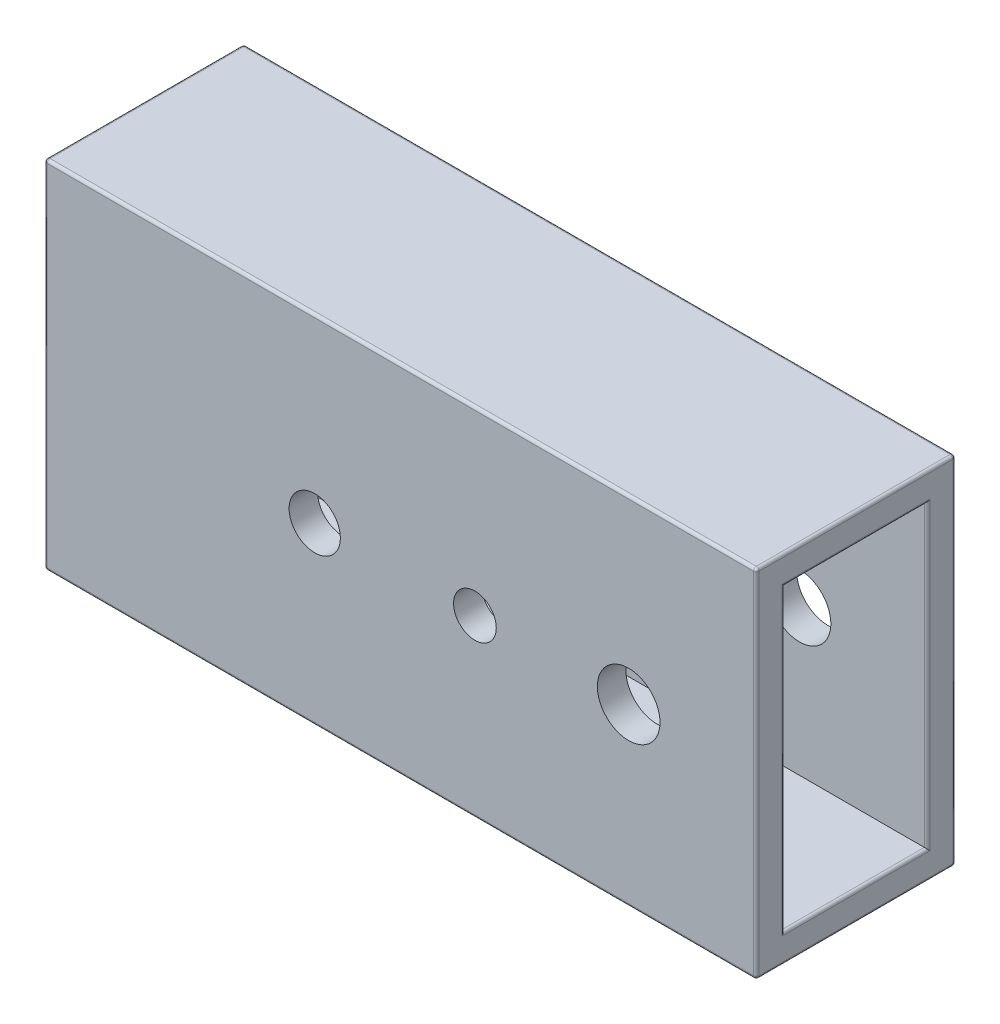
ISO-10303-21;
HEADER;
FILE_DESCRIPTION(('STEP AP214'),'2;1');
FILE_NAME('part.step','',(''),(''),'','','');
FILE_SCHEMA(('AUTOMOTIVE_DESIGN { 1 0 10303 214 1 1 1 1 }'));
ENDSEC;
DATA;
#1=APPLICATION_CONTEXT('core data for automotive mechanical design processes');
#2=APPLICATION_PROTOCOL_DEFINITION('international standard','automotive_design',2000,#1);
#3=PRODUCT_CONTEXT('',#1,'mechanical');
#4=PRODUCT('Part','Part','',(#3));
#5=PRODUCT_RELATED_PRODUCT_CATEGORY('part','',(#4));
#6=PRODUCT_DEFINITION_FORMATION('','',#4);
#7=PRODUCT_DEFINITION_CONTEXT('part definition',#1,'design');
#8=PRODUCT_DEFINITION('design','',#6,#7);
#9=PRODUCT_DEFINITION_SHAPE('','',#8);
#10=(LENGTH_UNIT() NAMED_UNIT(*) SI_UNIT(.MILLI.,.METRE.));
#11=(NAMED_UNIT(*) PLANE_ANGLE_UNIT() SI_UNIT($,.RADIAN.));
#12=(NAMED_UNIT(*) SI_UNIT($,.STERADIAN.) SOLID_ANGLE_UNIT());
#13=UNCERTAINTY_MEASURE_WITH_UNIT(LENGTH_MEASURE(1.E-05),#10,'distance_accuracy_value','');
#14=(GEOMETRIC_REPRESENTATION_CONTEXT(3) GLOBAL_UNCERTAINTY_ASSIGNED_CONTEXT((#13)) GLOBAL_UNIT_ASSIGNED_CONTEXT((#10,
#11,#12)) REPRESENTATION_CONTEXT('',''));
#15=CARTESIAN_POINT('',(0.,0.,0.));
#16=DIRECTION('',(0.,0.,1.));
#17=DIRECTION('',(1.,0.,0.));
#18=AXIS2_PLACEMENT_3D('',#15,#16,#17);
#19=CARTESIAN_POINT('',(-5.18828451882847,93.4309623430963,35.0000000000001));
#20=DIRECTION('',(-1.,0.,0.));
#21=DIRECTION('',(0.,-1.,0.));
#22=AXIS2_PLACEMENT_3D('',#19,#20,#21);
#23=PLANE('',#22);
#24=DIRECTION('',(0.,1.,0.));
#25=VECTOR('',#24,1.);
#26=CARTESIAN_POINT('',(-5.18828451882847,93.4309623430963,26.));
#27=LINE('',#26,#25);
#28=CARTESIAN_POINT('',(-5.18828451882846,-22.5690376569038,26.));
#29=VERTEX_POINT('',#28);
#30=CARTESIAN_POINT('',(-5.18828451882847,84.4309623430962,26.));
#31=VERTEX_POINT('',#30);
#32=EDGE_CURVE('E271',#29,#31,#27,.T.);
#33=ORIENTED_EDGE('',*,*,#32,.T.);
#34=DIRECTION('',(0.,0.,-1.));
#35=VECTOR('',#34,1.);
#36=CARTESIAN_POINT('',(-5.18828451882847,84.4309623430962,-25.));
#37=LINE('',#36,#35);
#38=CARTESIAN_POINT('',(-5.18828451882847,84.4309623430962,-26.));
#39=VERTEX_POINT('',#38);
#40=EDGE_CURVE('E273',#31,#39,#37,.T.);
#41=ORIENTED_EDGE('',*,*,#40,.T.);
#42=DIRECTION('',(0.,1.,0.));
#43=VECTOR('',#42,1.);
#44=CARTESIAN_POINT('',(-5.18828451882846,-21.5690376569038,-26.));
#45=LINE('',#44,#43);
#46=CARTESIAN_POINT('',(-5.18828451882846,-22.5690376569038,-26.));
#47=VERTEX_POINT('',#46);
#48=EDGE_CURVE('E267',#39,#47,#45,.F.);
#49=ORIENTED_EDGE('',*,*,#48,.T.);
#50=DIRECTION('',(0.,0.,-1.));
#51=VECTOR('',#50,1.);
#52=CARTESIAN_POINT('',(-5.18828451882846,-22.5690376569038,25.));
#53=LINE('',#52,#51);
#54=EDGE_CURVE('E269',#47,#29,#53,.F.);
#55=ORIENTED_EDGE('',*,*,#54,.T.);
#56=EDGE_LOOP('',(#33,#41,#49,#55));
#57=FACE_BOUND('',#56,.T.);
#58=DIRECTION('',(0.,1.,0.));
#59=VECTOR('',#58,1.);
#60=CARTESIAN_POINT('',(-5.18828451882846,-31.5690376569038,34.));
#61=LINE('',#60,#59);
#62=CARTESIAN_POINT('',(-5.18828451882847,92.4309623430963,34.));
#63=VERTEX_POINT('',#62);
#64=CARTESIAN_POINT('',(-5.18828451882846,-30.5690376569038,34.));
#65=VERTEX_POINT('',#64);
#66=EDGE_CURVE('E262',#63,#65,#61,.F.);
#67=ORIENTED_EDGE('',*,*,#66,.T.);
#68=DIRECTION('',(0.,0.,-1.));
#69=VECTOR('',#68,1.);
#70=CARTESIAN_POINT('',(-5.18828451882846,-30.5690376569038,35.0000000000001));
#71=LINE('',#70,#69);
#72=CARTESIAN_POINT('',(-5.18828451882846,-30.5690376569038,-34.));
#73=VERTEX_POINT('',#72);
#74=EDGE_CURVE('E264',#65,#73,#71,.T.);
#75=ORIENTED_EDGE('',*,*,#74,.T.);
#76=DIRECTION('',(0.,1.,0.));
#77=VECTOR('',#76,1.);
#78=CARTESIAN_POINT('',(-5.18828451882847,93.4309623430963,-34.));
#79=LINE('',#78,#77);
#80=CARTESIAN_POINT('',(-5.18828451882847,92.4309623430963,-34.));
#81=VERTEX_POINT('',#80);
#82=EDGE_CURVE('E260',#73,#81,#79,.T.);
#83=ORIENTED_EDGE('',*,*,#82,.T.);
#84=DIRECTION('',(0.,0.,-1.));
#85=VECTOR('',#84,1.);
#86=CARTESIAN_POINT('',(-5.18828451882847,92.4309623430963,35.0000000000001));
#87=LINE('',#86,#85);
#88=EDGE_CURVE('E258',#81,#63,#87,.F.);
#89=ORIENTED_EDGE('',*,*,#88,.T.);
#90=EDGE_LOOP('',(#67,#75,#83,#89));
#91=FACE_BOUND('',#90,.T.);
#92=ADVANCED_FACE('F47',(#57,#91),#23,.F.);
#93=CARTESIAN_POINT('',(-255.188284518828,93.4309623430963,35.));
#94=DIRECTION('',(0.,-1.,0.));
#95=DIRECTION('',(0.,0.,-1.));
#96=AXIS2_PLACEMENT_3D('',#93,#94,#95);
#97=PLANE('',#96);
#98=DIRECTION('',(-1.,0.,0.));
#99=VECTOR('',#98,1.);
#100=CARTESIAN_POINT('',(-5.18828451882847,93.4309623430963,34.));
#101=LINE('',#100,#99);
#102=CARTESIAN_POINT('',(-254.188284518828,93.4309623430963,34.));
#103=VERTEX_POINT('',#102);
#104=CARTESIAN_POINT('',(-6.18828451882847,93.4309623430963,34.));
#105=VERTEX_POINT('',#104);
#106=EDGE_CURVE('E56',#103,#105,#101,.F.);
#107=ORIENTED_EDGE('',*,*,#106,.T.);
#108=DIRECTION('',(0.,0.,-1.));
#109=VECTOR('',#108,1.);
#110=CARTESIAN_POINT('',(-6.18828451882847,93.4309623430963,35.));
#111=LINE('',#110,#109);
#112=CARTESIAN_POINT('',(-6.18828451882847,93.4309623430963,-34.));
#113=VERTEX_POINT('',#112);
#114=EDGE_CURVE('E11',#105,#113,#111,.T.);
#115=ORIENTED_EDGE('',*,*,#114,.T.);
#116=DIRECTION('',(-1.,0.,0.));
#117=VECTOR('',#116,1.);
#118=CARTESIAN_POINT('',(-255.188284518828,93.4309623430963,-34.));
#119=LINE('',#118,#117);
#120=CARTESIAN_POINT('',(-254.188284518828,93.4309623430963,-34.));
#121=VERTEX_POINT('',#120);
#122=EDGE_CURVE('E292',#113,#121,#119,.T.);
#123=ORIENTED_EDGE('',*,*,#122,.T.);
#124=DIRECTION('',(0.,0.,-1.));
#125=VECTOR('',#124,1.);
#126=CARTESIAN_POINT('',(-254.188284518828,93.4309623430963,35.));
#127=LINE('',#126,#125);
#128=EDGE_CURVE('E67',#121,#103,#127,.F.);
#129=ORIENTED_EDGE('',*,*,#128,.T.);
#130=EDGE_LOOP('',(#107,#115,#123,#129));
#131=FACE_BOUND('',#130,.T.);
#132=ADVANCED_FACE('F456',(#131),#97,.F.);
#133=CARTESIAN_POINT('',(-255.188284518828,93.4309623430963,35.));
#134=DIRECTION('',(1.,0.,0.));
#135=DIRECTION('',(0.,0.,-1.));
#136=AXIS2_PLACEMENT_3D('',#133,#134,#135);
#137=PLANE('',#136);
#138=DIRECTION('',(0.,0.,-1.));
#139=VECTOR('',#138,1.);
#140=CARTESIAN_POINT('',(-255.188284518828,-30.5690376569038,35.));
#141=LINE('',#140,#139);
#142=CARTESIAN_POINT('',(-255.188284518828,-30.5690376569038,-34.));
#143=VERTEX_POINT('',#142);
#144=CARTESIAN_POINT('',(-255.188284518828,-30.5690376569038,34.));
#145=VERTEX_POINT('',#144);
#146=EDGE_CURVE('E287',#143,#145,#141,.F.);
#147=ORIENTED_EDGE('',*,*,#146,.T.);
#148=DIRECTION('',(0.,-1.,0.));
#149=VECTOR('',#148,1.);
#150=CARTESIAN_POINT('',(-255.188284518828,93.4309623430963,34.));
#151=LINE('',#150,#149);
#152=CARTESIAN_POINT('',(-255.188284518828,92.4309623430963,34.));
#153=VERTEX_POINT('',#152);
#154=EDGE_CURVE('E289',#145,#153,#151,.F.);
#155=ORIENTED_EDGE('',*,*,#154,.T.);
#156=DIRECTION('',(0.,0.,-1.));
#157=VECTOR('',#156,1.);
#158=CARTESIAN_POINT('',(-255.188284518828,92.4309623430963,35.));
#159=LINE('',#158,#157);
#160=CARTESIAN_POINT('',(-255.188284518828,92.4309623430963,-34.));
#161=VERTEX_POINT('',#160);
#162=EDGE_CURVE('E283',#153,#161,#159,.T.);
#163=ORIENTED_EDGE('',*,*,#162,.T.);
#164=DIRECTION('',(0.,-1.,0.));
#165=VECTOR('',#164,1.);
#166=CARTESIAN_POINT('',(-255.188284518828,93.4309623430963,-34.));
#167=LINE('',#166,#165);
#168=EDGE_CURVE('E285',#161,#143,#167,.T.);
#169=ORIENTED_EDGE('',*,*,#168,.T.);
#170=EDGE_LOOP('',(#147,#155,#163,#169));
#171=FACE_BOUND('',#170,.T.);
#172=ADVANCED_FACE('F462',(#171),#137,.F.);
#173=CARTESIAN_POINT('',(-255.188284518828,-31.5690376569038,35.));
#174=DIRECTION('',(0.,1.,0.));
#175=DIRECTION('',(0.,0.,1.));
#176=AXIS2_PLACEMENT_3D('',#173,#174,#175);
#177=PLANE('',#176);
#178=DIRECTION('',(1.,0.,0.));
#179=VECTOR('',#178,1.);
#180=CARTESIAN_POINT('',(-255.188284518828,-31.5690376569038,-34.));
#181=LINE('',#180,#179);
#182=CARTESIAN_POINT('',(-254.188284518828,-31.5690376569038,-34.));
#183=VERTEX_POINT('',#182);
#184=CARTESIAN_POINT('',(-6.18828451882846,-31.5690376569038,-34.));
#185=VERTEX_POINT('',#184);
#186=EDGE_CURVE('E242',#183,#185,#181,.T.);
#187=ORIENTED_EDGE('',*,*,#186,.T.);
#188=DIRECTION('',(0.,0.,-1.));
#189=VECTOR('',#188,1.);
#190=CARTESIAN_POINT('',(-6.18828451882847,-31.5690376569038,35.));
#191=LINE('',#190,#189);
#192=CARTESIAN_POINT('',(-6.18828451882846,-31.5690376569038,34.));
#193=VERTEX_POINT('',#192);
#194=EDGE_CURVE('E247',#185,#193,#191,.F.);
#195=ORIENTED_EDGE('',*,*,#194,.T.);
#196=DIRECTION('',(1.,0.,0.));
#197=VECTOR('',#196,1.);
#198=CARTESIAN_POINT('',(-255.188284518828,-31.5690376569038,34.));
#199=LINE('',#198,#197);
#200=CARTESIAN_POINT('',(-254.188284518828,-31.5690376569038,34.));
#201=VERTEX_POINT('',#200);
#202=EDGE_CURVE('E244',#193,#201,#199,.F.);
#203=ORIENTED_EDGE('',*,*,#202,.T.);
#204=DIRECTION('',(0.,0.,-1.));
#205=VECTOR('',#204,1.);
#206=CARTESIAN_POINT('',(-254.188284518828,-31.5690376569038,35.));
#207=LINE('',#206,#205);
#208=EDGE_CURVE('E240',#201,#183,#207,.T.);
#209=ORIENTED_EDGE('',*,*,#208,.T.);
#210=EDGE_LOOP('',(#187,#195,#203,#209));
#211=FACE_BOUND('',#210,.T.);
#212=ADVANCED_FACE('F762',(#211),#177,.F.);
#213=CARTESIAN_POINT('',(0.,0.,35.));
#214=DIRECTION('',(0.,0.,1.));
#215=DIRECTION('',(1.,0.,0.));
#216=AXIS2_PLACEMENT_3D('',#213,#214,#215);
#217=PLANE('',#216);
#218=DIRECTION('',(0.,-1.,0.));
#219=VECTOR('',#218,1.);
#220=CARTESIAN_POINT('',(-254.188284518828,-31.5690376569038,35.));
#221=LINE('',#220,#219);
#222=CARTESIAN_POINT('',(-254.188284518828,92.4309623430963,35.));
#223=VERTEX_POINT('',#222);
#224=CARTESIAN_POINT('',(-254.188284518828,-30.5690376569038,35.));
#225=VERTEX_POINT('',#224);
#226=EDGE_CURVE('E233',#223,#225,#221,.T.);
#227=ORIENTED_EDGE('',*,*,#226,.T.);
#228=DIRECTION('',(1.,0.,0.));
#229=VECTOR('',#228,1.);
#230=CARTESIAN_POINT('',(-5.18828451882846,-30.5690376569038,35.));
#231=LINE('',#230,#229);
#232=CARTESIAN_POINT('',(-6.18828451882846,-30.5690376569038,35.));
#233=VERTEX_POINT('',#232);
#234=EDGE_CURVE('E237',#225,#233,#231,.T.);
#235=ORIENTED_EDGE('',*,*,#234,.T.);
#236=DIRECTION('',(0.,1.,0.));
#237=VECTOR('',#236,1.);
#238=CARTESIAN_POINT('',(-6.18828451882847,93.4309623430963,35.));
#239=LINE('',#238,#237);
#240=CARTESIAN_POINT('',(-6.18828451882847,92.4309623430963,35.));
#241=VERTEX_POINT('',#240);
#242=EDGE_CURVE('E235',#233,#241,#239,.T.);
#243=ORIENTED_EDGE('',*,*,#242,.T.);
#244=DIRECTION('',(-1.,0.,0.));
#245=VECTOR('',#244,1.);
#246=CARTESIAN_POINT('',(-255.188284518828,92.4309623430963,35.));
#247=LINE('',#246,#245);
#248=EDGE_CURVE('E193',#241,#223,#247,.T.);
#249=ORIENTED_EDGE('',*,*,#248,.T.);
#250=EDGE_LOOP('',(#227,#235,#243,#249));
#251=FACE_BOUND('',#250,.T.);
#252=CARTESIAN_POINT('',(-50.,30.,35.));
#253=DIRECTION('',(0.,0.,1.));
#254=DIRECTION('',(1.,0.,0.));
#255=AXIS2_PLACEMENT_3D('',#252,#253,#254);
#256=CIRCLE('',#255,11.);
#257=CARTESIAN_POINT('',(-39.,30.,35.));
#258=VERTEX_POINT('',#257);
#259=EDGE_CURVE('E408',#258,#258,#256,.T.);
#260=ORIENTED_EDGE('',*,*,#259,.F.);
#261=EDGE_LOOP('',(#260));
#262=FACE_BOUND('',#261,.T.);
#263=CARTESIAN_POINT('',(-104.,30.,35.));
#264=DIRECTION('',(0.,0.,1.));
#265=DIRECTION('',(1.,0.,0.));
#266=AXIS2_PLACEMENT_3D('',#263,#264,#265);
#267=CIRCLE('',#266,7.50000000000001);
#268=CARTESIAN_POINT('',(-96.5,30.,35.));
#269=VERTEX_POINT('',#268);
#270=EDGE_CURVE('E403',#269,#269,#267,.T.);
#271=ORIENTED_EDGE('',*,*,#270,.F.);
#272=EDGE_LOOP('',(#271));
#273=FACE_BOUND('',#272,.T.);
#274=CARTESIAN_POINT('',(-160.25,30.,35.));
#275=DIRECTION('',(0.,0.,1.));
#276=DIRECTION('',(1.,0.,0.));
#277=AXIS2_PLACEMENT_3D('',#274,#275,#276);
#278=CIRCLE('',#277,9.00000000000001);
#279=CARTESIAN_POINT('',(-151.25,30.,35.));
#280=VERTEX_POINT('',#279);
#281=EDGE_CURVE('E393',#280,#280,#278,.T.);
#282=ORIENTED_EDGE('',*,*,#281,.F.);
#283=EDGE_LOOP('',(#282));
#284=FACE_BOUND('',#283,.T.);
#285=ADVANCED_FACE('F752',(#251,#262,#273,#284),#217,.T.);
#286=CARTESIAN_POINT('',(0.,0.,-35.));
#287=DIRECTION('',(0.,0.,1.));
#288=DIRECTION('',(1.,0.,0.));
#289=AXIS2_PLACEMENT_3D('',#286,#287,#288);
#290=PLANE('',#289);
#291=DIRECTION('',(0.,1.,0.));
#292=VECTOR('',#291,1.);
#293=CARTESIAN_POINT('',(-6.18828451882846,0.,-35.));
#294=LINE('',#293,#292);
#295=CARTESIAN_POINT('',(-6.18828451882847,92.4309623430963,-35.));
#296=VERTEX_POINT('',#295);
#297=CARTESIAN_POINT('',(-6.18828451882846,-30.5690376569038,-35.));
#298=VERTEX_POINT('',#297);
#299=EDGE_CURVE('E253',#296,#298,#294,.F.);
#300=ORIENTED_EDGE('',*,*,#299,.T.);
#301=DIRECTION('',(1.,0.,0.));
#302=VECTOR('',#301,1.);
#303=CARTESIAN_POINT('',(0.,-30.5690376569038,-35.));
#304=LINE('',#303,#302);
#305=CARTESIAN_POINT('',(-254.188284518828,-30.5690376569038,-35.));
#306=VERTEX_POINT('',#305);
#307=EDGE_CURVE('E255',#298,#306,#304,.F.);
#308=ORIENTED_EDGE('',*,*,#307,.T.);
#309=DIRECTION('',(0.,-1.,0.));
#310=VECTOR('',#309,1.);
#311=CARTESIAN_POINT('',(-254.188284518828,0.,-35.));
#312=LINE('',#311,#310);
#313=CARTESIAN_POINT('',(-254.188284518828,92.4309623430963,-35.));
#314=VERTEX_POINT('',#313);
#315=EDGE_CURVE('E251',#306,#314,#312,.F.);
#316=ORIENTED_EDGE('',*,*,#315,.T.);
#317=DIRECTION('',(-1.,0.,0.));
#318=VECTOR('',#317,1.);
#319=CARTESIAN_POINT('',(0.,92.4309623430963,-35.));
#320=LINE('',#319,#318);
#321=EDGE_CURVE('E249',#314,#296,#320,.F.);
#322=ORIENTED_EDGE('',*,*,#321,.T.);
#323=EDGE_LOOP('',(#300,#308,#316,#322));
#324=FACE_BOUND('',#323,.T.);
#325=CARTESIAN_POINT('',(-50.,30.,-35.));
#326=DIRECTION('',(0.,0.,1.));
#327=DIRECTION('',(1.,0.,0.));
#328=AXIS2_PLACEMENT_3D('',#325,#326,#327);
#329=CIRCLE('',#328,11.);
#330=CARTESIAN_POINT('',(-39.,30.,-35.));
#331=VERTEX_POINT('',#330);
#332=EDGE_CURVE('E222',#331,#331,#329,.T.);
#333=ORIENTED_EDGE('',*,*,#332,.T.);
#334=EDGE_LOOP('',(#333));
#335=FACE_BOUND('',#334,.T.);
#336=CARTESIAN_POINT('',(-104.,30.,-35.));
#337=DIRECTION('',(0.,0.,1.));
#338=DIRECTION('',(1.,0.,0.));
#339=AXIS2_PLACEMENT_3D('',#336,#337,#338);
#340=CIRCLE('',#339,7.50000000000001);
#341=CARTESIAN_POINT('',(-96.5,30.,-35.));
#342=VERTEX_POINT('',#341);
#343=EDGE_CURVE('E398',#342,#342,#340,.T.);
#344=ORIENTED_EDGE('',*,*,#343,.T.);
#345=EDGE_LOOP('',(#344));
#346=FACE_BOUND('',#345,.T.);
#347=CARTESIAN_POINT('',(-160.25,30.,-35.));
#348=DIRECTION('',(0.,0.,1.));
#349=DIRECTION('',(1.,0.,0.));
#350=AXIS2_PLACEMENT_3D('',#347,#348,#349);
#351=CIRCLE('',#350,9.00000000000001);
#352=CARTESIAN_POINT('',(-151.25,30.,-35.));
#353=VERTEX_POINT('',#352);
#354=EDGE_CURVE('E362',#353,#353,#351,.T.);
#355=ORIENTED_EDGE('',*,*,#354,.T.);
#356=EDGE_LOOP('',(#355));
#357=FACE_BOUND('',#356,.T.);
#358=ADVANCED_FACE('F739',(#324,#335,#346,#357),#290,.F.);
#359=CARTESIAN_POINT('',(-255.188284518828,83.4309623430962,35.));
#360=DIRECTION('',(0.,-1.,0.));
#361=DIRECTION('',(0.,0.,-1.));
#362=AXIS2_PLACEMENT_3D('',#359,#360,#361);
#363=PLANE('',#362);
#364=DIRECTION('',(-1.,0.,0.));
#365=VECTOR('',#364,1.);
#366=CARTESIAN_POINT('',(-255.188284518828,83.4309623430962,-25.));
#367=LINE('',#366,#365);
#368=CARTESIAN_POINT('',(-6.18828451882847,83.4309623430962,-25.));
#369=VERTEX_POINT('',#368);
#370=CARTESIAN_POINT('',(-245.188284518828,83.4309623430962,-25.));
#371=VERTEX_POINT('',#370);
#372=EDGE_CURVE('E170',#369,#371,#367,.T.);
#373=ORIENTED_EDGE('',*,*,#372,.F.);
#374=DIRECTION('',(0.,0.,-1.));
#375=VECTOR('',#374,1.);
#376=CARTESIAN_POINT('',(-6.18828451882847,83.4309623430962,25.));
#377=LINE('',#376,#375);
#378=CARTESIAN_POINT('',(-6.18828451882847,83.4309623430962,25.));
#379=VERTEX_POINT('',#378);
#380=EDGE_CURVE('E276',#369,#379,#377,.F.);
#381=ORIENTED_EDGE('',*,*,#380,.T.);
#382=DIRECTION('',(-1.,0.,0.));
#383=VECTOR('',#382,1.);
#384=CARTESIAN_POINT('',(-255.188284518828,83.4309623430962,25.));
#385=LINE('',#384,#383);
#386=CARTESIAN_POINT('',(-245.188284518828,83.4309623430962,25.));
#387=VERTEX_POINT('',#386);
#388=EDGE_CURVE('E189',#379,#387,#385,.T.);
#389=ORIENTED_EDGE('',*,*,#388,.T.);
#390=DIRECTION('',(0.,0.,-1.));
#391=VECTOR('',#390,1.);
#392=CARTESIAN_POINT('',(-245.188284518828,83.4309623430962,35.));
#393=LINE('',#392,#391);
#394=EDGE_CURVE('E186',#387,#371,#393,.T.);
#395=ORIENTED_EDGE('',*,*,#394,.T.);
#396=EDGE_LOOP('',(#373,#381,#389,#395));
#397=FACE_BOUND('',#396,.T.);
#398=ADVANCED_FACE('F187',(#397),#363,.T.);
#399=CARTESIAN_POINT('',(-245.188284518828,93.4309623430963,35.));
#400=DIRECTION('',(1.,0.,0.));
#401=DIRECTION('',(0.,0.,-1.));
#402=AXIS2_PLACEMENT_3D('',#399,#400,#401);
#403=PLANE('',#402);
#404=DIRECTION('',(0.,-1.,0.));
#405=VECTOR('',#404,1.);
#406=CARTESIAN_POINT('',(-245.188284518828,93.4309623430963,-25.));
#407=LINE('',#406,#405);
#408=CARTESIAN_POINT('',(-245.188284518828,-21.5690376569038,-25.));
#409=VERTEX_POINT('',#408);
#410=EDGE_CURVE('E175',#371,#409,#407,.T.);
#411=ORIENTED_EDGE('',*,*,#410,.F.);
#412=ORIENTED_EDGE('',*,*,#394,.F.);
#413=DIRECTION('',(0.,-1.,0.));
#414=VECTOR('',#413,1.);
#415=CARTESIAN_POINT('',(-245.188284518828,93.4309623430963,25.));
#416=LINE('',#415,#414);
#417=CARTESIAN_POINT('',(-245.188284518828,-21.5690376569038,25.));
#418=VERTEX_POINT('',#417);
#419=EDGE_CURVE('E211',#387,#418,#416,.T.);
#420=ORIENTED_EDGE('',*,*,#419,.T.);
#421=DIRECTION('',(0.,0.,-1.));
#422=VECTOR('',#421,1.);
#423=CARTESIAN_POINT('',(-245.188284518828,-21.5690376569038,35.));
#424=LINE('',#423,#422);
#425=EDGE_CURVE('E194',#418,#409,#424,.T.);
#426=ORIENTED_EDGE('',*,*,#425,.T.);
#427=EDGE_LOOP('',(#411,#412,#420,#426));
#428=FACE_BOUND('',#427,.T.);
#429=ADVANCED_FACE('F196',(#428),#403,.T.);
#430=CARTESIAN_POINT('',(-255.188284518828,-21.5690376569038,35.));
#431=DIRECTION('',(0.,1.,0.));
#432=DIRECTION('',(0.,0.,1.));
#433=AXIS2_PLACEMENT_3D('',#430,#431,#432);
#434=PLANE('',#433);
#435=DIRECTION('',(1.,0.,0.));
#436=VECTOR('',#435,1.);
#437=CARTESIAN_POINT('',(-255.188284518828,-21.5690376569038,25.));
#438=LINE('',#437,#436);
#439=CARTESIAN_POINT('',(-6.18828451882844,-21.5690376569038,25.));
#440=VERTEX_POINT('',#439);
#441=EDGE_CURVE('E210',#418,#440,#438,.T.);
#442=ORIENTED_EDGE('',*,*,#441,.T.);
#443=DIRECTION('',(0.,0.,-1.));
#444=VECTOR('',#443,1.);
#445=CARTESIAN_POINT('',(-6.18828451882844,-21.5690376569038,-25.));
#446=LINE('',#445,#444);
#447=CARTESIAN_POINT('',(-6.18828451882847,-21.5690376569038,-25.));
#448=VERTEX_POINT('',#447);
#449=EDGE_CURVE('E280',#440,#448,#446,.T.);
#450=ORIENTED_EDGE('',*,*,#449,.T.);
#451=DIRECTION('',(1.,0.,0.));
#452=VECTOR('',#451,1.);
#453=CARTESIAN_POINT('',(-255.188284518828,-21.5690376569038,-25.));
#454=LINE('',#453,#452);
#455=EDGE_CURVE('E200',#409,#448,#454,.T.);
#456=ORIENTED_EDGE('',*,*,#455,.F.);
#457=ORIENTED_EDGE('',*,*,#425,.F.);
#458=EDGE_LOOP('',(#442,#450,#456,#457));
#459=FACE_BOUND('',#458,.T.);
#460=ADVANCED_FACE('F382',(#459),#434,.T.);
#461=CARTESIAN_POINT('',(0.,0.,25.));
#462=DIRECTION('',(0.,0.,1.));
#463=DIRECTION('',(1.,0.,0.));
#464=AXIS2_PLACEMENT_3D('',#461,#462,#463);
#465=PLANE('',#464);
#466=CARTESIAN_POINT('',(-50.,30.,25.));
#467=DIRECTION('',(0.,0.,1.));
#468=DIRECTION('',(1.,0.,0.));
#469=AXIS2_PLACEMENT_3D('',#466,#467,#468);
#470=CIRCLE('',#469,11.);
#471=CARTESIAN_POINT('',(-39.,30.,25.));
#472=VERTEX_POINT('',#471);
#473=EDGE_CURVE('E183',#472,#472,#470,.T.);
#474=ORIENTED_EDGE('',*,*,#473,.T.);
#475=EDGE_LOOP('',(#474));
#476=FACE_BOUND('',#475,.T.);
#477=CARTESIAN_POINT('',(-104.,30.,25.));
#478=DIRECTION('',(0.,0.,1.));
#479=DIRECTION('',(1.,0.,0.));
#480=AXIS2_PLACEMENT_3D('',#477,#478,#479);
#481=CIRCLE('',#480,7.50000000000001);
#482=CARTESIAN_POINT('',(-96.5,30.,25.));
#483=VERTEX_POINT('',#482);
#484=EDGE_CURVE('E227',#483,#483,#481,.T.);
#485=ORIENTED_EDGE('',*,*,#484,.T.);
#486=EDGE_LOOP('',(#485));
#487=FACE_BOUND('',#486,.T.);
#488=CARTESIAN_POINT('',(-160.25,30.,25.));
#489=DIRECTION('',(0.,0.,1.));
#490=DIRECTION('',(1.,0.,0.));
#491=AXIS2_PLACEMENT_3D('',#488,#489,#490);
#492=CIRCLE('',#491,9.00000000000001);
#493=CARTESIAN_POINT('',(-151.25,30.,25.));
#494=VERTEX_POINT('',#493);
#495=EDGE_CURVE('E221',#494,#494,#492,.T.);
#496=ORIENTED_EDGE('',*,*,#495,.T.);
#497=EDGE_LOOP('',(#496));
#498=FACE_BOUND('',#497,.T.);
#499=ORIENTED_EDGE('',*,*,#388,.F.);
#500=DIRECTION('',(0.,1.,0.));
#501=VECTOR('',#500,1.);
#502=CARTESIAN_POINT('',(-6.18828451882846,0.,25.));
#503=LINE('',#502,#501);
#504=EDGE_CURVE('E278',#379,#440,#503,.F.);
#505=ORIENTED_EDGE('',*,*,#504,.T.);
#506=ORIENTED_EDGE('',*,*,#441,.F.);
#507=ORIENTED_EDGE('',*,*,#419,.F.);
#508=EDGE_LOOP('',(#499,#505,#506,#507));
#509=FACE_BOUND('',#508,.T.);
#510=ADVANCED_FACE('F385',(#476,#487,#498,#509),#465,.F.);
#511=CARTESIAN_POINT('',(0.,0.,-25.));
#512=DIRECTION('',(0.,0.,1.));
#513=DIRECTION('',(1.,0.,0.));
#514=AXIS2_PLACEMENT_3D('',#511,#512,#513);
#515=PLANE('',#514);
#516=CARTESIAN_POINT('',(-50.,30.,-25.));
#517=DIRECTION('',(0.,0.,1.));
#518=DIRECTION('',(1.,0.,0.));
#519=AXIS2_PLACEMENT_3D('',#516,#517,#518);
#520=CIRCLE('',#519,11.);
#521=CARTESIAN_POINT('',(-39.,30.,-25.));
#522=VERTEX_POINT('',#521);
#523=EDGE_CURVE('E228',#522,#522,#520,.T.);
#524=ORIENTED_EDGE('',*,*,#523,.F.);
#525=EDGE_LOOP('',(#524));
#526=FACE_BOUND('',#525,.T.);
#527=CARTESIAN_POINT('',(-104.,30.,-25.));
#528=DIRECTION('',(0.,0.,1.));
#529=DIRECTION('',(1.,0.,0.));
#530=AXIS2_PLACEMENT_3D('',#527,#528,#529);
#531=CIRCLE('',#530,7.50000000000001);
#532=CARTESIAN_POINT('',(-96.5,30.,-25.));
#533=VERTEX_POINT('',#532);
#534=EDGE_CURVE('E223',#533,#533,#531,.T.);
#535=ORIENTED_EDGE('',*,*,#534,.F.);
#536=EDGE_LOOP('',(#535));
#537=FACE_BOUND('',#536,.T.);
#538=CARTESIAN_POINT('',(-160.25,30.,-25.));
#539=DIRECTION('',(0.,0.,1.));
#540=DIRECTION('',(1.,0.,0.));
#541=AXIS2_PLACEMENT_3D('',#538,#539,#540);
#542=CIRCLE('',#541,9.00000000000001);
#543=CARTESIAN_POINT('',(-151.25,30.,-25.));
#544=VERTEX_POINT('',#543);
#545=EDGE_CURVE('E217',#544,#544,#542,.T.);
#546=ORIENTED_EDGE('',*,*,#545,.F.);
#547=EDGE_LOOP('',(#546));
#548=FACE_BOUND('',#547,.T.);
#549=ORIENTED_EDGE('',*,*,#455,.T.);
#550=DIRECTION('',(0.,1.,0.));
#551=VECTOR('',#550,1.);
#552=CARTESIAN_POINT('',(-6.18828451882847,83.4309623430962,-25.));
#553=LINE('',#552,#551);
#554=EDGE_CURVE('E178',#448,#369,#553,.T.);
#555=ORIENTED_EDGE('',*,*,#554,.T.);
#556=ORIENTED_EDGE('',*,*,#372,.T.);
#557=ORIENTED_EDGE('',*,*,#410,.T.);
#558=EDGE_LOOP('',(#549,#555,#556,#557));
#559=FACE_BOUND('',#558,.T.);
#560=ADVANCED_FACE('F173',(#526,#537,#548,#559),#515,.T.);
#561=CARTESIAN_POINT('',(-160.25,30.,-35.));
#562=DIRECTION('',(0.,0.,1.));
#563=DIRECTION('',(1.,0.,0.));
#564=AXIS2_PLACEMENT_3D('',#561,#562,#563);
#565=CYLINDRICAL_SURFACE('',#564,9.00000000000001);
#566=ORIENTED_EDGE('',*,*,#545,.T.);
#567=EDGE_LOOP('',(#566));
#568=FACE_BOUND('',#567,.T.);
#569=ORIENTED_EDGE('',*,*,#354,.F.);
#570=EDGE_LOOP('',(#569));
#571=FACE_BOUND('',#570,.T.);
#572=ADVANCED_FACE('F676',(#568,#571),#565,.F.);
#573=CARTESIAN_POINT('',(-104.,30.,-35.));
#574=DIRECTION('',(0.,0.,1.));
#575=DIRECTION('',(1.,0.,0.));
#576=AXIS2_PLACEMENT_3D('',#573,#574,#575);
#577=CYLINDRICAL_SURFACE('',#576,7.50000000000001);
#578=ORIENTED_EDGE('',*,*,#534,.T.);
#579=EDGE_LOOP('',(#578));
#580=FACE_BOUND('',#579,.T.);
#581=ORIENTED_EDGE('',*,*,#343,.F.);
#582=EDGE_LOOP('',(#581));
#583=FACE_BOUND('',#582,.T.);
#584=ADVANCED_FACE('F452',(#580,#583),#577,.F.);
#585=CARTESIAN_POINT('',(-50.,30.,-35.));
#586=DIRECTION('',(0.,0.,1.));
#587=DIRECTION('',(1.,0.,0.));
#588=AXIS2_PLACEMENT_3D('',#585,#586,#587);
#589=CYLINDRICAL_SURFACE('',#588,11.);
#590=ORIENTED_EDGE('',*,*,#523,.T.);
#591=EDGE_LOOP('',(#590));
#592=FACE_BOUND('',#591,.T.);
#593=ORIENTED_EDGE('',*,*,#332,.F.);
#594=EDGE_LOOP('',(#593));
#595=FACE_BOUND('',#594,.T.);
#596=ADVANCED_FACE('F441',(#592,#595),#589,.F.);
#597=ORIENTED_EDGE('',*,*,#281,.T.);
#598=EDGE_LOOP('',(#597));
#599=FACE_BOUND('',#598,.T.);
#600=ORIENTED_EDGE('',*,*,#495,.F.);
#601=EDGE_LOOP('',(#600));
#602=FACE_BOUND('',#601,.T.);
#603=ADVANCED_FACE('F449',(#599,#602),#565,.F.);
#604=ORIENTED_EDGE('',*,*,#270,.T.);
#605=EDGE_LOOP('',(#604));
#606=FACE_BOUND('',#605,.T.);
#607=ORIENTED_EDGE('',*,*,#484,.F.);
#608=EDGE_LOOP('',(#607));
#609=FACE_BOUND('',#608,.T.);
#610=ADVANCED_FACE('F438',(#606,#609),#577,.F.);
#611=ORIENTED_EDGE('',*,*,#259,.T.);
#612=EDGE_LOOP('',(#611));
#613=FACE_BOUND('',#612,.T.);
#614=ORIENTED_EDGE('',*,*,#473,.F.);
#615=EDGE_LOOP('',(#614));
#616=FACE_BOUND('',#615,.T.);
#617=ADVANCED_FACE('F435',(#613,#616),#589,.F.);
#618=CARTESIAN_POINT('',(-255.188284518828,92.4309623430963,-34.));
#619=DIRECTION('',(-1.,0.,0.));
#620=DIRECTION('',(0.,0.,1.));
#621=AXIS2_PLACEMENT_3D('',#618,#619,#620);
#622=CYLINDRICAL_SURFACE('',#621,1.);
#623=CARTESIAN_POINT('',(-254.188284518828,92.4309623430963,-34.));
#624=DIRECTION('',(-1.,0.,0.));
#625=DIRECTION('',(0.,0.,1.));
#626=AXIS2_PLACEMENT_3D('',#623,#624,#625);
#627=CIRCLE('',#626,1.);
#628=EDGE_CURVE('E359',#121,#314,#627,.T.);
#629=ORIENTED_EDGE('',*,*,#628,.F.);
#630=ORIENTED_EDGE('',*,*,#122,.F.);
#631=CARTESIAN_POINT('',(-6.18828451882847,92.4309623430963,-34.));
#632=DIRECTION('',(1.,0.,0.));
#633=DIRECTION('',(0.,1.,0.));
#634=AXIS2_PLACEMENT_3D('',#631,#632,#633);
#635=CIRCLE('',#634,1.);
#636=EDGE_CURVE('E356',#296,#113,#635,.T.);
#637=ORIENTED_EDGE('',*,*,#636,.F.);
#638=ORIENTED_EDGE('',*,*,#321,.F.);
#639=EDGE_LOOP('',(#629,#630,#637,#638));
#640=FACE_BOUND('',#639,.T.);
#641=ADVANCED_FACE('F437',(#640),#622,.T.);
#642=CARTESIAN_POINT('',(-254.188284518828,92.4309623430963,-34.));
#643=DIRECTION('',(0.,0.,-1.));
#644=DIRECTION('',(-1.,0.,0.));
#645=AXIS2_PLACEMENT_3D('',#642,#643,#644);
#646=SPHERICAL_SURFACE('',#645,1.);
#647=CARTESIAN_POINT('',(-254.188284518828,92.4309623430963,-34.));
#648=DIRECTION('',(0.,0.,-1.));
#649=DIRECTION('',(-1.,0.,0.));
#650=AXIS2_PLACEMENT_3D('',#647,#648,#649);
#651=CIRCLE('',#650,1.);
#652=EDGE_CURVE('E350',#121,#161,#651,.F.);
#653=ORIENTED_EDGE('',*,*,#652,.F.);
#654=ORIENTED_EDGE('',*,*,#628,.T.);
#655=CARTESIAN_POINT('',(-254.188284518828,92.4309623430963,-34.));
#656=DIRECTION('',(0.,1.,0.));
#657=DIRECTION('',(0.,0.,1.));
#658=AXIS2_PLACEMENT_3D('',#655,#656,#657);
#659=CIRCLE('',#658,1.);
#660=EDGE_CURVE('E353',#161,#314,#659,.F.);
#661=ORIENTED_EDGE('',*,*,#660,.F.);
#662=EDGE_LOOP('',(#653,#654,#661));
#663=FACE_BOUND('',#662,.T.);
#664=ADVANCED_FACE('F446',(#663),#646,.T.);
#665=CARTESIAN_POINT('',(-6.18828451882847,92.4309623430963,-34.));
#666=DIRECTION('',(0.,1.,0.));
#667=DIRECTION('',(-1.,0.,0.));
#668=AXIS2_PLACEMENT_3D('',#665,#666,#667);
#669=SPHERICAL_SURFACE('',#668,1.);
#670=CARTESIAN_POINT('',(-6.18828451882847,92.4309623430963,-34.));
#671=DIRECTION('',(0.,1.,0.));
#672=DIRECTION('',(0.,0.,1.));
#673=AXIS2_PLACEMENT_3D('',#670,#671,#672);
#674=CIRCLE('',#673,1.);
#675=EDGE_CURVE('E345',#296,#81,#674,.F.);
#676=ORIENTED_EDGE('',*,*,#675,.F.);
#677=ORIENTED_EDGE('',*,*,#636,.T.);
#678=CARTESIAN_POINT('',(-6.18828451882847,92.4309623430963,-34.));
#679=DIRECTION('',(0.,0.,-1.));
#680=DIRECTION('',(-1.,0.,0.));
#681=AXIS2_PLACEMENT_3D('',#678,#679,#680);
#682=CIRCLE('',#681,1.);
#683=EDGE_CURVE('E348',#81,#113,#682,.F.);
#684=ORIENTED_EDGE('',*,*,#683,.F.);
#685=EDGE_LOOP('',(#676,#677,#684));
#686=FACE_BOUND('',#685,.T.);
#687=ADVANCED_FACE('F534',(#686),#669,.T.);
#688=CARTESIAN_POINT('',(-254.188284518828,93.4309623430963,-34.));
#689=DIRECTION('',(0.,-1.,0.));
#690=DIRECTION('',(0.,0.,-1.));
#691=AXIS2_PLACEMENT_3D('',#688,#689,#690);
#692=CYLINDRICAL_SURFACE('',#691,1.);
#693=ORIENTED_EDGE('',*,*,#660,.T.);
#694=ORIENTED_EDGE('',*,*,#315,.F.);
#695=CARTESIAN_POINT('',(-254.188284518828,-30.5690376569038,-34.));
#696=DIRECTION('',(0.,-1.,0.));
#697=DIRECTION('',(0.,0.,-1.));
#698=AXIS2_PLACEMENT_3D('',#695,#696,#697);
#699=CIRCLE('',#698,1.);
#700=EDGE_CURVE('E340',#143,#306,#699,.T.);
#701=ORIENTED_EDGE('',*,*,#700,.F.);
#702=ORIENTED_EDGE('',*,*,#168,.F.);
#703=EDGE_LOOP('',(#693,#694,#701,#702));
#704=FACE_BOUND('',#703,.T.);
#705=ADVANCED_FACE('F530',(#704),#692,.T.);
#706=CARTESIAN_POINT('',(-254.188284518828,92.4309623430963,35.));
#707=DIRECTION('',(0.,0.,-1.));
#708=DIRECTION('',(-1.,0.,0.));
#709=AXIS2_PLACEMENT_3D('',#706,#707,#708);
#710=CYLINDRICAL_SURFACE('',#709,1.);
#711=ORIENTED_EDGE('',*,*,#652,.T.);
#712=ORIENTED_EDGE('',*,*,#162,.F.);
#713=CARTESIAN_POINT('',(-254.188284518828,92.4309623430963,34.));
#714=DIRECTION('',(0.,0.,1.));
#715=DIRECTION('',(1.,0.,0.));
#716=AXIS2_PLACEMENT_3D('',#713,#714,#715);
#717=CIRCLE('',#716,1.);
#718=EDGE_CURVE('E337',#103,#153,#717,.T.);
#719=ORIENTED_EDGE('',*,*,#718,.F.);
#720=ORIENTED_EDGE('',*,*,#128,.F.);
#721=EDGE_LOOP('',(#711,#712,#719,#720));
#722=FACE_BOUND('',#721,.T.);
#723=ADVANCED_FACE('F526',(#722),#710,.T.);
#724=CARTESIAN_POINT('',(0.,92.4309623430963,34.));
#725=DIRECTION('',(1.,0.,0.));
#726=DIRECTION('',(0.,0.,-1.));
#727=AXIS2_PLACEMENT_3D('',#724,#725,#726);
#728=CYLINDRICAL_SURFACE('',#727,1.);
#729=CARTESIAN_POINT('',(-6.18828451882847,92.4309623430963,34.));
#730=DIRECTION('',(1.,0.,0.));
#731=DIRECTION('',(0.,0.,-1.));
#732=AXIS2_PLACEMENT_3D('',#729,#730,#731);
#733=CIRCLE('',#732,1.);
#734=EDGE_CURVE('E331',#105,#241,#733,.T.);
#735=ORIENTED_EDGE('',*,*,#734,.F.);
#736=ORIENTED_EDGE('',*,*,#106,.F.);
#737=CARTESIAN_POINT('',(-254.188284518828,92.4309623430963,34.));
#738=DIRECTION('',(-1.,0.,0.));
#739=DIRECTION('',(0.,0.,1.));
#740=AXIS2_PLACEMENT_3D('',#737,#738,#739);
#741=CIRCLE('',#740,1.);
#742=EDGE_CURVE('E334',#223,#103,#741,.T.);
#743=ORIENTED_EDGE('',*,*,#742,.F.);
#744=ORIENTED_EDGE('',*,*,#248,.F.);
#745=EDGE_LOOP('',(#735,#736,#743,#744));
#746=FACE_BOUND('',#745,.T.);
#747=ADVANCED_FACE('F522',(#746),#728,.T.);
#748=CARTESIAN_POINT('',(-6.18828451882847,92.4309623430963,35.));
#749=DIRECTION('',(0.,0.,-1.));
#750=DIRECTION('',(-1.,0.,0.));
#751=AXIS2_PLACEMENT_3D('',#748,#749,#750);
#752=CYLINDRICAL_SURFACE('',#751,1.);
#753=ORIENTED_EDGE('',*,*,#683,.T.);
#754=ORIENTED_EDGE('',*,*,#114,.F.);
#755=CARTESIAN_POINT('',(-6.18828451882847,92.4309623430963,34.));
#756=DIRECTION('',(0.,0.,1.));
#757=DIRECTION('',(1.,0.,0.));
#758=AXIS2_PLACEMENT_3D('',#755,#756,#757);
#759=CIRCLE('',#758,1.);
#760=EDGE_CURVE('E328',#63,#105,#759,.T.);
#761=ORIENTED_EDGE('',*,*,#760,.F.);
#762=ORIENTED_EDGE('',*,*,#88,.F.);
#763=EDGE_LOOP('',(#753,#754,#761,#762));
#764=FACE_BOUND('',#763,.T.);
#765=ADVANCED_FACE('F518',(#764),#752,.T.);
#766=CARTESIAN_POINT('',(-6.18828451882847,93.4309623430963,-34.));
#767=DIRECTION('',(0.,1.,0.));
#768=DIRECTION('',(-1.,0.,0.));
#769=AXIS2_PLACEMENT_3D('',#766,#767,#768);
#770=CYLINDRICAL_SURFACE('',#769,1.);
#771=ORIENTED_EDGE('',*,*,#675,.T.);
#772=ORIENTED_EDGE('',*,*,#82,.F.);
#773=CARTESIAN_POINT('',(-6.18828451882846,-30.5690376569038,-34.));
#774=DIRECTION('',(0.,-1.,0.));
#775=DIRECTION('',(0.,0.,-1.));
#776=AXIS2_PLACEMENT_3D('',#773,#774,#775);
#777=CIRCLE('',#776,1.);
#778=EDGE_CURVE('E325',#298,#73,#777,.T.);
#779=ORIENTED_EDGE('',*,*,#778,.F.);
#780=ORIENTED_EDGE('',*,*,#299,.F.);
#781=EDGE_LOOP('',(#771,#772,#779,#780));
#782=FACE_BOUND('',#781,.T.);
#783=ADVANCED_FACE('F514',(#782),#770,.T.);
#784=CARTESIAN_POINT('',(-255.188284518828,-30.5690376569038,-34.));
#785=DIRECTION('',(1.,0.,0.));
#786=DIRECTION('',(0.,0.,-1.));
#787=AXIS2_PLACEMENT_3D('',#784,#785,#786);
#788=CYLINDRICAL_SURFACE('',#787,1.);
#789=CARTESIAN_POINT('',(-254.188284518828,-30.5690376569038,-34.));
#790=DIRECTION('',(-1.,0.,0.));
#791=DIRECTION('',(0.,0.,1.));
#792=AXIS2_PLACEMENT_3D('',#789,#790,#791);
#793=CIRCLE('',#792,1.);
#794=EDGE_CURVE('E342',#306,#183,#793,.T.);
#795=ORIENTED_EDGE('',*,*,#794,.F.);
#796=ORIENTED_EDGE('',*,*,#307,.F.);
#797=CARTESIAN_POINT('',(-6.18828451882846,-30.5690376569038,-34.));
#798=DIRECTION('',(1.,0.,0.));
#799=DIRECTION('',(0.,0.,-1.));
#800=AXIS2_PLACEMENT_3D('',#797,#798,#799);
#801=CIRCLE('',#800,1.);
#802=EDGE_CURVE('E322',#185,#298,#801,.T.);
#803=ORIENTED_EDGE('',*,*,#802,.F.);
#804=ORIENTED_EDGE('',*,*,#186,.F.);
#805=EDGE_LOOP('',(#795,#796,#803,#804));
#806=FACE_BOUND('',#805,.T.);
#807=ADVANCED_FACE('F510',(#806),#788,.T.);
#808=CARTESIAN_POINT('',(-254.188284518828,-30.5690376569038,-34.));
#809=DIRECTION('',(0.,0.,-1.));
#810=DIRECTION('',(-1.,0.,0.));
#811=AXIS2_PLACEMENT_3D('',#808,#809,#810);
#812=SPHERICAL_SURFACE('',#811,1.);
#813=ORIENTED_EDGE('',*,*,#700,.T.);
#814=ORIENTED_EDGE('',*,*,#794,.T.);
#815=CARTESIAN_POINT('',(-254.188284518828,-30.5690376569038,-34.));
#816=DIRECTION('',(0.,0.,-1.));
#817=DIRECTION('',(-1.,0.,0.));
#818=AXIS2_PLACEMENT_3D('',#815,#816,#817);
#819=CIRCLE('',#818,1.);
#820=EDGE_CURVE('E319',#143,#183,#819,.F.);
#821=ORIENTED_EDGE('',*,*,#820,.F.);
#822=EDGE_LOOP('',(#813,#814,#821));
#823=FACE_BOUND('',#822,.T.);
#824=ADVANCED_FACE('F506',(#823),#812,.T.);
#825=CARTESIAN_POINT('',(-254.188284518828,92.4309623430963,34.));
#826=DIRECTION('',(0.,1.,0.));
#827=DIRECTION('',(0.,0.,1.));
#828=AXIS2_PLACEMENT_3D('',#825,#826,#827);
#829=SPHERICAL_SURFACE('',#828,1.);
#830=ORIENTED_EDGE('',*,*,#742,.T.);
#831=ORIENTED_EDGE('',*,*,#718,.T.);
#832=CARTESIAN_POINT('',(-254.188284518828,92.4309623430963,34.));
#833=DIRECTION('',(0.,1.,0.));
#834=DIRECTION('',(0.,0.,1.));
#835=AXIS2_PLACEMENT_3D('',#832,#833,#834);
#836=CIRCLE('',#835,1.);
#837=EDGE_CURVE('E317',#223,#153,#836,.F.);
#838=ORIENTED_EDGE('',*,*,#837,.F.);
#839=EDGE_LOOP('',(#830,#831,#838));
#840=FACE_BOUND('',#839,.T.);
#841=ADVANCED_FACE('F502',(#840),#829,.T.);
#842=CARTESIAN_POINT('',(-6.18828451882847,92.4309623430963,34.));
#843=DIRECTION('',(0.,1.,0.));
#844=DIRECTION('',(-1.,0.,0.));
#845=AXIS2_PLACEMENT_3D('',#842,#843,#844);
#846=SPHERICAL_SURFACE('',#845,1.);
#847=ORIENTED_EDGE('',*,*,#760,.T.);
#848=ORIENTED_EDGE('',*,*,#734,.T.);
#849=CARTESIAN_POINT('',(-6.18828451882847,92.4309623430963,34.));
#850=DIRECTION('',(0.,1.,0.));
#851=DIRECTION('',(0.,0.,1.));
#852=AXIS2_PLACEMENT_3D('',#849,#850,#851);
#853=CIRCLE('',#852,1.);
#854=EDGE_CURVE('E314',#63,#241,#853,.F.);
#855=ORIENTED_EDGE('',*,*,#854,.F.);
#856=EDGE_LOOP('',(#847,#848,#855));
#857=FACE_BOUND('',#856,.T.);
#858=ADVANCED_FACE('F498',(#857),#846,.T.);
#859=CARTESIAN_POINT('',(-6.18828451882846,-30.5690376569038,-34.));
#860=DIRECTION('',(0.,0.,-1.));
#861=DIRECTION('',(-1.,0.,0.));
#862=AXIS2_PLACEMENT_3D('',#859,#860,#861);
#863=SPHERICAL_SURFACE('',#862,1.);
#864=ORIENTED_EDGE('',*,*,#802,.T.);
#865=ORIENTED_EDGE('',*,*,#778,.T.);
#866=CARTESIAN_POINT('',(-6.18828451882846,-30.5690376569038,-34.));
#867=DIRECTION('',(0.,0.,-1.));
#868=DIRECTION('',(-1.,0.,0.));
#869=AXIS2_PLACEMENT_3D('',#866,#867,#868);
#870=CIRCLE('',#869,1.);
#871=EDGE_CURVE('E312',#185,#73,#870,.F.);
#872=ORIENTED_EDGE('',*,*,#871,.F.);
#873=EDGE_LOOP('',(#864,#865,#872));
#874=FACE_BOUND('',#873,.T.);
#875=ADVANCED_FACE('F494',(#874),#863,.T.);
#876=CARTESIAN_POINT('',(-254.188284518828,-30.5690376569038,35.));
#877=DIRECTION('',(0.,0.,-1.));
#878=DIRECTION('',(-1.,0.,0.));
#879=AXIS2_PLACEMENT_3D('',#876,#877,#878);
#880=CYLINDRICAL_SURFACE('',#879,1.);
#881=ORIENTED_EDGE('',*,*,#820,.T.);
#882=ORIENTED_EDGE('',*,*,#208,.F.);
#883=CARTESIAN_POINT('',(-254.188284518828,-30.5690376569038,34.));
#884=DIRECTION('',(0.,0.,1.));
#885=DIRECTION('',(1.,0.,0.));
#886=AXIS2_PLACEMENT_3D('',#883,#884,#885);
#887=CIRCLE('',#886,1.);
#888=EDGE_CURVE('E309',#145,#201,#887,.T.);
#889=ORIENTED_EDGE('',*,*,#888,.F.);
#890=ORIENTED_EDGE('',*,*,#146,.F.);
#891=EDGE_LOOP('',(#881,#882,#889,#890));
#892=FACE_BOUND('',#891,.T.);
#893=ADVANCED_FACE('F490',(#892),#880,.T.);
#894=CARTESIAN_POINT('',(-254.188284518828,0.,34.));
#895=DIRECTION('',(0.,1.,0.));
#896=DIRECTION('',(0.,0.,1.));
#897=AXIS2_PLACEMENT_3D('',#894,#895,#896);
#898=CYLINDRICAL_SURFACE('',#897,1.);
#899=ORIENTED_EDGE('',*,*,#837,.T.);
#900=ORIENTED_EDGE('',*,*,#154,.F.);
#901=CARTESIAN_POINT('',(-254.188284518828,-30.5690376569038,34.));
#902=DIRECTION('',(0.,-1.,0.));
#903=DIRECTION('',(0.,0.,-1.));
#904=AXIS2_PLACEMENT_3D('',#901,#902,#903);
#905=CIRCLE('',#904,1.);
#906=EDGE_CURVE('E306',#225,#145,#905,.T.);
#907=ORIENTED_EDGE('',*,*,#906,.F.);
#908=ORIENTED_EDGE('',*,*,#226,.F.);
#909=EDGE_LOOP('',(#899,#900,#907,#908));
#910=FACE_BOUND('',#909,.T.);
#911=ADVANCED_FACE('F486',(#910),#898,.T.);
#912=CARTESIAN_POINT('',(-6.18828451882846,0.,34.));
#913=DIRECTION('',(0.,-1.,0.));
#914=DIRECTION('',(1.,0.,0.));
#915=AXIS2_PLACEMENT_3D('',#912,#913,#914);
#916=CYLINDRICAL_SURFACE('',#915,1.);
#917=ORIENTED_EDGE('',*,*,#854,.T.);
#918=ORIENTED_EDGE('',*,*,#242,.F.);
#919=CARTESIAN_POINT('',(-6.18828451882846,-30.5690376569038,34.));
#920=DIRECTION('',(0.,-1.,0.));
#921=DIRECTION('',(0.,0.,-1.));
#922=AXIS2_PLACEMENT_3D('',#919,#920,#921);
#923=CIRCLE('',#922,1.);
#924=EDGE_CURVE('E303',#65,#233,#923,.T.);
#925=ORIENTED_EDGE('',*,*,#924,.F.);
#926=ORIENTED_EDGE('',*,*,#66,.F.);
#927=EDGE_LOOP('',(#917,#918,#925,#926));
#928=FACE_BOUND('',#927,.T.);
#929=ADVANCED_FACE('F482',(#928),#916,.T.);
#930=CARTESIAN_POINT('',(-6.18828451882846,-30.5690376569038,35.0000000000001));
#931=DIRECTION('',(0.,0.,-1.));
#932=DIRECTION('',(-1.,0.,0.));
#933=AXIS2_PLACEMENT_3D('',#930,#931,#932);
#934=CYLINDRICAL_SURFACE('',#933,1.);
#935=ORIENTED_EDGE('',*,*,#871,.T.);
#936=ORIENTED_EDGE('',*,*,#74,.F.);
#937=CARTESIAN_POINT('',(-6.18828451882846,-30.5690376569038,34.));
#938=DIRECTION('',(0.,0.,1.));
#939=DIRECTION('',(1.,0.,0.));
#940=AXIS2_PLACEMENT_3D('',#937,#938,#939);
#941=CIRCLE('',#940,1.);
#942=EDGE_CURVE('E300',#193,#65,#941,.T.);
#943=ORIENTED_EDGE('',*,*,#942,.F.);
#944=ORIENTED_EDGE('',*,*,#194,.F.);
#945=EDGE_LOOP('',(#935,#936,#943,#944));
#946=FACE_BOUND('',#945,.T.);
#947=ADVANCED_FACE('F478',(#946),#934,.T.);
#948=CARTESIAN_POINT('',(-254.188284518828,-30.5690376569038,34.));
#949=DIRECTION('',(-1.,0.,0.));
#950=DIRECTION('',(0.,0.,1.));
#951=AXIS2_PLACEMENT_3D('',#948,#949,#950);
#952=SPHERICAL_SURFACE('',#951,1.);
#953=ORIENTED_EDGE('',*,*,#906,.T.);
#954=ORIENTED_EDGE('',*,*,#888,.T.);
#955=CARTESIAN_POINT('',(-254.188284518828,-30.5690376569038,34.));
#956=DIRECTION('',(-1.,0.,0.));
#957=DIRECTION('',(0.,0.,1.));
#958=AXIS2_PLACEMENT_3D('',#955,#956,#957);
#959=CIRCLE('',#958,1.);
#960=EDGE_CURVE('E298',#225,#201,#959,.F.);
#961=ORIENTED_EDGE('',*,*,#960,.F.);
#962=EDGE_LOOP('',(#953,#954,#961));
#963=FACE_BOUND('',#962,.T.);
#964=ADVANCED_FACE('F474',(#963),#952,.T.);
#965=CARTESIAN_POINT('',(-6.18828451882846,-30.5690376569038,34.));
#966=DIRECTION('',(1.,0.,0.));
#967=DIRECTION('',(0.,0.,-1.));
#968=AXIS2_PLACEMENT_3D('',#965,#966,#967);
#969=SPHERICAL_SURFACE('',#968,1.);
#970=ORIENTED_EDGE('',*,*,#942,.T.);
#971=ORIENTED_EDGE('',*,*,#924,.T.);
#972=CARTESIAN_POINT('',(-6.18828451882846,-30.5690376569038,34.));
#973=DIRECTION('',(1.,0.,0.));
#974=DIRECTION('',(0.,0.,-1.));
#975=AXIS2_PLACEMENT_3D('',#972,#973,#974);
#976=CIRCLE('',#975,1.);
#977=EDGE_CURVE('E296',#193,#233,#976,.F.);
#978=ORIENTED_EDGE('',*,*,#977,.F.);
#979=EDGE_LOOP('',(#970,#971,#978));
#980=FACE_BOUND('',#979,.T.);
#981=ADVANCED_FACE('F470',(#980),#969,.T.);
#982=CARTESIAN_POINT('',(0.,-30.5690376569038,34.));
#983=DIRECTION('',(-1.,0.,0.));
#984=DIRECTION('',(0.,0.,1.));
#985=AXIS2_PLACEMENT_3D('',#982,#983,#984);
#986=CYLINDRICAL_SURFACE('',#985,1.);
#987=ORIENTED_EDGE('',*,*,#960,.T.);
#988=ORIENTED_EDGE('',*,*,#202,.F.);
#989=ORIENTED_EDGE('',*,*,#977,.T.);
#990=ORIENTED_EDGE('',*,*,#234,.F.);
#991=EDGE_LOOP('',(#987,#988,#989,#990));
#992=FACE_BOUND('',#991,.T.);
#993=ADVANCED_FACE('F467',(#992),#986,.T.);
#994=CARTESIAN_POINT('',(-6.18828451882844,-22.5690376569038,35.));
#995=DIRECTION('',(0.,0.,1.));
#996=DIRECTION('',(1.,0.,0.));
#997=AXIS2_PLACEMENT_3D('',#994,#995,#996);
#998=CYLINDRICAL_SURFACE('',#997,1.);
#999=CARTESIAN_POINT('',(-6.18828451882845,-22.5690376569038,-26.));
#1000=DIRECTION('',(0.,-0.707106781186547,0.707106781186547));
#1001=DIRECTION('',(0.,0.707106781186547,0.707106781186547));
#1002=AXIS2_PLACEMENT_3D('',#999,#1000,#1001);
#1003=ELLIPSE('',#1002,1.41421356237309,1.);
#1004=EDGE_CURVE('E366',#448,#47,#1003,.F.);
#1005=ORIENTED_EDGE('',*,*,#1004,.F.);
#1006=ORIENTED_EDGE('',*,*,#449,.F.);
#1007=CARTESIAN_POINT('',(-6.18828451882845,-22.5690376569038,26.));
#1008=DIRECTION('',(0.,0.707106781186547,0.707106781186547));
#1009=DIRECTION('',(0.,0.707106781186547,-0.707106781186547));
#1010=AXIS2_PLACEMENT_3D('',#1007,#1008,#1009);
#1011=ELLIPSE('',#1010,1.41421356237309,1.);
#1012=EDGE_CURVE('E51',#29,#440,#1011,.T.);
#1013=ORIENTED_EDGE('',*,*,#1012,.F.);
#1014=ORIENTED_EDGE('',*,*,#54,.F.);
#1015=EDGE_LOOP('',(#1005,#1006,#1013,#1014));
#1016=FACE_BOUND('',#1015,.T.);
#1017=ADVANCED_FACE('F49',(#1016),#998,.T.);
#1018=CARTESIAN_POINT('',(-6.18828451882847,93.4309623430963,26.));
#1019=DIRECTION('',(0.,1.,0.));
#1020=DIRECTION('',(-1.,0.,0.));
#1021=AXIS2_PLACEMENT_3D('',#1018,#1019,#1020);
#1022=CYLINDRICAL_SURFACE('',#1021,1.);
#1023=ORIENTED_EDGE('',*,*,#1012,.T.);
#1024=ORIENTED_EDGE('',*,*,#504,.F.);
#1025=CARTESIAN_POINT('',(-6.18828451882847,84.4309623430962,26.));
#1026=DIRECTION('',(0.,-0.707106781186547,0.707106781186547));
#1027=DIRECTION('',(0.,0.707106781186547,0.707106781186547));
#1028=AXIS2_PLACEMENT_3D('',#1025,#1026,#1027);
#1029=ELLIPSE('',#1028,1.41421356237309,1.);
#1030=EDGE_CURVE('E365',#31,#379,#1029,.F.);
#1031=ORIENTED_EDGE('',*,*,#1030,.F.);
#1032=ORIENTED_EDGE('',*,*,#32,.F.);
#1033=EDGE_LOOP('',(#1023,#1024,#1031,#1032));
#1034=FACE_BOUND('',#1033,.T.);
#1035=ADVANCED_FACE('F376',(#1034),#1022,.T.);
#1036=CARTESIAN_POINT('',(-6.18828451882846,0.,-26.));
#1037=DIRECTION('',(0.,-1.,0.));
#1038=DIRECTION('',(1.,0.,0.));
#1039=AXIS2_PLACEMENT_3D('',#1036,#1037,#1038);
#1040=CYLINDRICAL_SURFACE('',#1039,1.);
#1041=ORIENTED_EDGE('',*,*,#1004,.T.);
#1042=ORIENTED_EDGE('',*,*,#48,.F.);
#1043=CARTESIAN_POINT('',(-6.18828451882847,84.4309623430962,-26.));
#1044=DIRECTION('',(0.,0.707106781186547,0.707106781186547));
#1045=DIRECTION('',(0.,-0.707106781186547,0.707106781186547));
#1046=AXIS2_PLACEMENT_3D('',#1043,#1044,#1045);
#1047=ELLIPSE('',#1046,1.41421356237309,1.);
#1048=EDGE_CURVE('E363',#369,#39,#1047,.T.);
#1049=ORIENTED_EDGE('',*,*,#1048,.F.);
#1050=ORIENTED_EDGE('',*,*,#554,.F.);
#1051=EDGE_LOOP('',(#1041,#1042,#1049,#1050));
#1052=FACE_BOUND('',#1051,.T.);
#1053=ADVANCED_FACE('F545',(#1052),#1040,.T.);
#1054=CARTESIAN_POINT('',(-6.18828451882847,84.4309623430962,35.0000000000001));
#1055=DIRECTION('',(0.,0.,1.));
#1056=DIRECTION('',(1.,0.,0.));
#1057=AXIS2_PLACEMENT_3D('',#1054,#1055,#1056);
#1058=CYLINDRICAL_SURFACE('',#1057,1.);
#1059=ORIENTED_EDGE('',*,*,#1030,.T.);
#1060=ORIENTED_EDGE('',*,*,#380,.F.);
#1061=ORIENTED_EDGE('',*,*,#1048,.T.);
#1062=ORIENTED_EDGE('',*,*,#40,.F.);
#1063=EDGE_LOOP('',(#1059,#1060,#1061,#1062));
#1064=FACE_BOUND('',#1063,.T.);
#1065=ADVANCED_FACE('F542',(#1064),#1058,.T.);
#1066=CLOSED_SHELL('',(#92,#132,#172,#212,#285,#358,#398,#429,#460,#510,#560,#572,#584,#596,
#603,#610,#617,#641,#664,#687,#705,#723,#747,#765,#783,#807,#824,#841,#858,#875,#893,#911,#929,
#947,#964,#981,#993,#1017,#1035,#1053,#1065));
#1067=MANIFOLD_SOLID_BREP('B2',#1066);
#1068=ADVANCED_BREP_SHAPE_REPRESENTATION('',(#18,#1067),#14);
#1069=SHAPE_DEFINITION_REPRESENTATION(#9,#1068);
ENDSEC;
END-ISO-10303-21;
